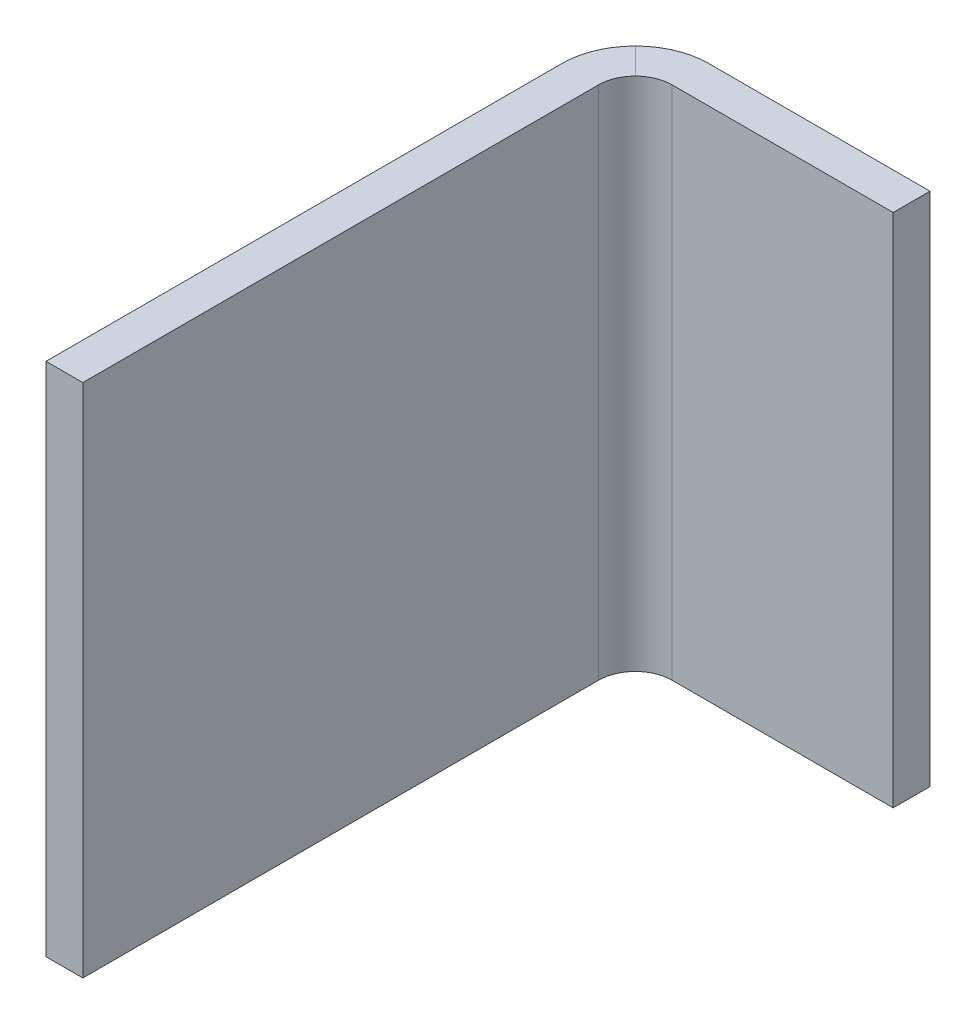
ISO-10303-21;
HEADER;
FILE_DESCRIPTION(('STEP AP214'),'2;1');
FILE_NAME('part.step','',(''),(''),'','','');
FILE_SCHEMA(('AUTOMOTIVE_DESIGN { 1 0 10303 214 1 1 1 1 }'));
ENDSEC;
DATA;
#1=APPLICATION_CONTEXT('core data for automotive mechanical design processes');
#2=APPLICATION_PROTOCOL_DEFINITION('international standard','automotive_design',2000,#1);
#3=PRODUCT_CONTEXT('',#1,'mechanical');
#4=PRODUCT('Part','Part','',(#3));
#5=PRODUCT_RELATED_PRODUCT_CATEGORY('part','',(#4));
#6=PRODUCT_DEFINITION_FORMATION('','',#4);
#7=PRODUCT_DEFINITION_CONTEXT('part definition',#1,'design');
#8=PRODUCT_DEFINITION('design','',#6,#7);
#9=PRODUCT_DEFINITION_SHAPE('','',#8);
#10=(LENGTH_UNIT() NAMED_UNIT(*) SI_UNIT(.MILLI.,.METRE.));
#11=(NAMED_UNIT(*) PLANE_ANGLE_UNIT() SI_UNIT($,.RADIAN.));
#12=(NAMED_UNIT(*) SI_UNIT($,.STERADIAN.) SOLID_ANGLE_UNIT());
#13=UNCERTAINTY_MEASURE_WITH_UNIT(LENGTH_MEASURE(1.E-05),#10,'distance_accuracy_value','');
#14=(GEOMETRIC_REPRESENTATION_CONTEXT(3) GLOBAL_UNCERTAINTY_ASSIGNED_CONTEXT((#13)) GLOBAL_UNIT_ASSIGNED_CONTEXT((#10,
#11,#12)) REPRESENTATION_CONTEXT('',''));
#15=CARTESIAN_POINT('',(0.,0.,0.));
#16=DIRECTION('',(0.,0.,1.));
#17=DIRECTION('',(1.,0.,0.));
#18=AXIS2_PLACEMENT_3D('',#15,#16,#17);
#19=CARTESIAN_POINT('',(25.4,0.,-50.8));
#20=DIRECTION('',(-1.,0.,0.));
#21=DIRECTION('',(0.,0.,1.));
#22=AXIS2_PLACEMENT_3D('',#19,#20,#21);
#23=PLANE('',#22);
#24=DIRECTION('',(0.,1.,0.));
#25=VECTOR('',#24,1.);
#26=CARTESIAN_POINT('',(25.4,-22.225,-47.625));
#27=LINE('',#26,#25);
#28=CARTESIAN_POINT('',(25.4,-22.225,-47.625));
#29=VERTEX_POINT('',#28);
#30=CARTESIAN_POINT('',(25.4,22.225,-47.625));
#31=VERTEX_POINT('',#30);
#32=EDGE_CURVE('E165',#29,#31,#27,.T.);
#33=ORIENTED_EDGE('',*,*,#32,.F.);
#34=DIRECTION('',(0.,0.,1.));
#35=VECTOR('',#34,1.);
#36=CARTESIAN_POINT('',(25.4,-22.225,-47.625));
#37=LINE('',#36,#35);
#38=CARTESIAN_POINT('',(25.4,-22.225,-50.8));
#39=VERTEX_POINT('',#38);
#40=EDGE_CURVE('E151',#39,#29,#37,.T.);
#41=ORIENTED_EDGE('',*,*,#40,.F.);
#42=DIRECTION('',(0.,-1.,0.));
#43=VECTOR('',#42,1.);
#44=CARTESIAN_POINT('',(25.4,-22.225,-50.8));
#45=LINE('',#44,#43);
#46=CARTESIAN_POINT('',(25.4,22.225,-50.8));
#47=VERTEX_POINT('',#46);
#48=EDGE_CURVE('E156',#47,#39,#45,.T.);
#49=ORIENTED_EDGE('',*,*,#48,.F.);
#50=DIRECTION('',(0.,0.,-1.));
#51=VECTOR('',#50,1.);
#52=CARTESIAN_POINT('',(25.4,22.225,-47.625));
#53=LINE('',#52,#51);
#54=EDGE_CURVE('E161',#31,#47,#53,.T.);
#55=ORIENTED_EDGE('',*,*,#54,.F.);
#56=EDGE_LOOP('',(#33,#41,#49,#55));
#57=FACE_BOUND('',#56,.T.);
#58=ADVANCED_FACE('F34',(#57),#23,.F.);
#59=CARTESIAN_POINT('',(0.,0.,0.));
#60=DIRECTION('',(0.,0.,1.));
#61=DIRECTION('',(1.,0.,0.));
#62=AXIS2_PLACEMENT_3D('',#59,#60,#61);
#63=PLANE('',#62);
#64=DIRECTION('',(0.,1.,0.));
#65=VECTOR('',#64,1.);
#66=CARTESIAN_POINT('',(3.175,-22.225,0.));
#67=LINE('',#66,#65);
#68=CARTESIAN_POINT('',(3.175,-22.225,0.));
#69=VERTEX_POINT('',#68);
#70=CARTESIAN_POINT('',(3.17499999999999,22.225,0.));
#71=VERTEX_POINT('',#70);
#72=EDGE_CURVE('E142',#69,#71,#67,.T.);
#73=ORIENTED_EDGE('',*,*,#72,.T.);
#74=DIRECTION('',(-1.,0.,0.));
#75=VECTOR('',#74,1.);
#76=CARTESIAN_POINT('',(3.17499999999999,22.225,0.));
#77=LINE('',#76,#75);
#78=CARTESIAN_POINT('',(0.,22.225,0.));
#79=VERTEX_POINT('',#78);
#80=EDGE_CURVE('E124',#71,#79,#77,.T.);
#81=ORIENTED_EDGE('',*,*,#80,.T.);
#82=DIRECTION('',(0.,-1.,0.));
#83=VECTOR('',#82,1.);
#84=CARTESIAN_POINT('',(0.,-22.225,0.));
#85=LINE('',#84,#83);
#86=CARTESIAN_POINT('',(0.,-22.225,0.));
#87=VERTEX_POINT('',#86);
#88=EDGE_CURVE('E120',#79,#87,#85,.T.);
#89=ORIENTED_EDGE('',*,*,#88,.T.);
#90=DIRECTION('',(1.,0.,0.));
#91=VECTOR('',#90,1.);
#92=CARTESIAN_POINT('',(3.175,-22.225,0.));
#93=LINE('',#92,#91);
#94=EDGE_CURVE('E111',#87,#69,#93,.T.);
#95=ORIENTED_EDGE('',*,*,#94,.T.);
#96=EDGE_LOOP('',(#73,#81,#89,#95));
#97=FACE_BOUND('',#96,.T.);
#98=ADVANCED_FACE('F123',(#97),#63,.T.);
#99=CARTESIAN_POINT('',(0.,-22.225,-47.625));
#100=DIRECTION('',(0.,0.,-1.));
#101=DIRECTION('',(0.,1.,0.));
#102=AXIS2_PLACEMENT_3D('',#99,#100,#101);
#103=PLANE('',#102);
#104=DIRECTION('',(1.,0.,0.));
#105=VECTOR('',#104,1.);
#106=CARTESIAN_POINT('',(0.,22.225,-47.625));
#107=LINE('',#106,#105);
#108=CARTESIAN_POINT('',(6.34999999999999,22.225,-47.625));
#109=VERTEX_POINT('',#108);
#110=EDGE_CURVE('E164',#109,#31,#107,.T.);
#111=ORIENTED_EDGE('',*,*,#110,.F.);
#112=DIRECTION('',(0.,-1.,0.));
#113=VECTOR('',#112,1.);
#114=CARTESIAN_POINT('',(6.35,-22.225,-47.625));
#115=LINE('',#114,#113);
#116=CARTESIAN_POINT('',(6.35,-22.225,-47.625));
#117=VERTEX_POINT('',#116);
#118=EDGE_CURVE('E143',#109,#117,#115,.T.);
#119=ORIENTED_EDGE('',*,*,#118,.T.);
#120=DIRECTION('',(1.,0.,0.));
#121=VECTOR('',#120,1.);
#122=CARTESIAN_POINT('',(0.,-22.225,-47.625));
#123=LINE('',#122,#121);
#124=EDGE_CURVE('E147',#117,#29,#123,.T.);
#125=ORIENTED_EDGE('',*,*,#124,.T.);
#126=ORIENTED_EDGE('',*,*,#32,.T.);
#127=EDGE_LOOP('',(#111,#119,#125,#126));
#128=FACE_BOUND('',#127,.T.);
#129=ADVANCED_FACE('F206',(#128),#103,.F.);
#130=CARTESIAN_POINT('',(0.,22.225,-47.625));
#131=DIRECTION('',(0.,-1.,0.));
#132=DIRECTION('',(0.,0.,-1.));
#133=AXIS2_PLACEMENT_3D('',#130,#131,#132);
#134=PLANE('',#133);
#135=DIRECTION('',(1.,0.,0.));
#136=VECTOR('',#135,1.);
#137=CARTESIAN_POINT('',(0.,22.225,-50.8));
#138=LINE('',#137,#136);
#139=CARTESIAN_POINT('',(6.34999999999999,22.225,-50.8));
#140=VERTEX_POINT('',#139);
#141=EDGE_CURVE('E159',#140,#47,#138,.T.);
#142=ORIENTED_EDGE('',*,*,#141,.F.);
#143=CARTESIAN_POINT('',(6.34999999999999,22.225,-44.45));
#144=DIRECTION('',(0.,-1.,0.));
#145=DIRECTION('',(0.,0.,-1.));
#146=AXIS2_PLACEMENT_3D('',#143,#144,#145);
#147=CIRCLE('',#146,6.35);
#148=CARTESIAN_POINT('',(1.85987193946541,22.225,-48.9401280605346));
#149=VERTEX_POINT('',#148);
#150=EDGE_CURVE('E42',#140,#149,#147,.F.);
#151=ORIENTED_EDGE('',*,*,#150,.T.);
#152=DIRECTION('',(0.707106781186548,0.,0.707106781186548));
#153=VECTOR('',#152,1.);
#154=CARTESIAN_POINT('',(26.9875,22.225,-23.8125));
#155=LINE('',#154,#153);
#156=CARTESIAN_POINT('',(4.1049359697327,22.225,-46.6950640302673));
#157=VERTEX_POINT('',#156);
#158=EDGE_CURVE('E134',#149,#157,#155,.T.);
#159=ORIENTED_EDGE('',*,*,#158,.T.);
#160=CARTESIAN_POINT('',(6.34999999999999,22.225,-44.45));
#161=DIRECTION('',(0.,-1.,0.));
#162=DIRECTION('',(0.,0.,-1.));
#163=AXIS2_PLACEMENT_3D('',#160,#161,#162);
#164=CIRCLE('',#163,3.175);
#165=EDGE_CURVE('E182',#157,#109,#164,.T.);
#166=ORIENTED_EDGE('',*,*,#165,.T.);
#167=ORIENTED_EDGE('',*,*,#110,.T.);
#168=ORIENTED_EDGE('',*,*,#54,.T.);
#169=EDGE_LOOP('',(#142,#151,#159,#166,#167,#168));
#170=FACE_BOUND('',#169,.T.);
#171=ADVANCED_FACE('F201',(#170),#134,.F.);
#172=CARTESIAN_POINT('',(0.,-22.225,-50.8));
#173=DIRECTION('',(0.,0.,1.));
#174=DIRECTION('',(0.,-1.,0.));
#175=AXIS2_PLACEMENT_3D('',#172,#173,#174);
#176=PLANE('',#175);
#177=DIRECTION('',(1.,0.,0.));
#178=VECTOR('',#177,1.);
#179=CARTESIAN_POINT('',(0.,-22.225,-50.8));
#180=LINE('',#179,#178);
#181=CARTESIAN_POINT('',(6.35,-22.225,-50.8));
#182=VERTEX_POINT('',#181);
#183=EDGE_CURVE('E154',#182,#39,#180,.T.);
#184=ORIENTED_EDGE('',*,*,#183,.F.);
#185=DIRECTION('',(0.,-1.,0.));
#186=VECTOR('',#185,1.);
#187=CARTESIAN_POINT('',(6.35,-22.225,-50.8));
#188=LINE('',#187,#186);
#189=EDGE_CURVE('E56',#182,#140,#188,.F.);
#190=ORIENTED_EDGE('',*,*,#189,.T.);
#191=ORIENTED_EDGE('',*,*,#141,.T.);
#192=ORIENTED_EDGE('',*,*,#48,.T.);
#193=EDGE_LOOP('',(#184,#190,#191,#192));
#194=FACE_BOUND('',#193,.T.);
#195=ADVANCED_FACE('F193',(#194),#176,.F.);
#196=CARTESIAN_POINT('',(0.,-22.225,-47.625));
#197=DIRECTION('',(0.,1.,0.));
#198=DIRECTION('',(0.,0.,1.));
#199=AXIS2_PLACEMENT_3D('',#196,#197,#198);
#200=PLANE('',#199);
#201=DIRECTION('',(-0.707106781186548,0.,-0.707106781186548));
#202=VECTOR('',#201,1.);
#203=CARTESIAN_POINT('',(26.9875,-22.225,-23.8125));
#204=LINE('',#203,#202);
#205=CARTESIAN_POINT('',(4.10493596973271,-22.225,-46.6950640302673));
#206=VERTEX_POINT('',#205);
#207=CARTESIAN_POINT('',(1.85987193946542,-22.225,-48.9401280605346));
#208=VERTEX_POINT('',#207);
#209=EDGE_CURVE('E138',#206,#208,#204,.T.);
#210=ORIENTED_EDGE('',*,*,#209,.T.);
#211=CARTESIAN_POINT('',(6.35,-22.225,-44.45));
#212=DIRECTION('',(0.,1.,0.));
#213=DIRECTION('',(0.,0.,1.));
#214=AXIS2_PLACEMENT_3D('',#211,#212,#213);
#215=CIRCLE('',#214,6.35);
#216=EDGE_CURVE('E187',#208,#182,#215,.F.);
#217=ORIENTED_EDGE('',*,*,#216,.T.);
#218=ORIENTED_EDGE('',*,*,#183,.T.);
#219=ORIENTED_EDGE('',*,*,#40,.T.);
#220=ORIENTED_EDGE('',*,*,#124,.F.);
#221=CARTESIAN_POINT('',(6.35,-22.225,-44.45));
#222=DIRECTION('',(0.,1.,0.));
#223=DIRECTION('',(0.,0.,1.));
#224=AXIS2_PLACEMENT_3D('',#221,#222,#223);
#225=CIRCLE('',#224,3.175);
#226=EDGE_CURVE('E174',#117,#206,#225,.T.);
#227=ORIENTED_EDGE('',*,*,#226,.T.);
#228=EDGE_LOOP('',(#210,#217,#218,#219,#220,#227));
#229=FACE_BOUND('',#228,.T.);
#230=ADVANCED_FACE('F191',(#229),#200,.F.);
#231=CARTESIAN_POINT('',(0.,-22.225,0.));
#232=DIRECTION('',(1.,0.,0.));
#233=DIRECTION('',(0.,1.,0.));
#234=AXIS2_PLACEMENT_3D('',#231,#232,#233);
#235=PLANE('',#234);
#236=DIRECTION('',(0.,0.,-1.));
#237=VECTOR('',#236,1.);
#238=CARTESIAN_POINT('',(0.,22.225,0.));
#239=LINE('',#238,#237);
#240=CARTESIAN_POINT('',(0.,22.225,-44.45));
#241=VERTEX_POINT('',#240);
#242=EDGE_CURVE('E133',#79,#241,#239,.T.);
#243=ORIENTED_EDGE('',*,*,#242,.T.);
#244=DIRECTION('',(0.,-1.,0.));
#245=VECTOR('',#244,1.);
#246=CARTESIAN_POINT('',(0.,-22.225,-44.45));
#247=LINE('',#246,#245);
#248=CARTESIAN_POINT('',(0.,-22.225,-44.45));
#249=VERTEX_POINT('',#248);
#250=EDGE_CURVE('E132',#241,#249,#247,.T.);
#251=ORIENTED_EDGE('',*,*,#250,.T.);
#252=DIRECTION('',(0.,0.,-1.));
#253=VECTOR('',#252,1.);
#254=CARTESIAN_POINT('',(0.,-22.225,0.));
#255=LINE('',#254,#253);
#256=EDGE_CURVE('E115',#87,#249,#255,.T.);
#257=ORIENTED_EDGE('',*,*,#256,.F.);
#258=ORIENTED_EDGE('',*,*,#88,.F.);
#259=EDGE_LOOP('',(#243,#251,#257,#258));
#260=FACE_BOUND('',#259,.T.);
#261=ADVANCED_FACE('F130',(#260),#235,.F.);
#262=CARTESIAN_POINT('',(3.175,-22.225,0.));
#263=DIRECTION('',(-1.,0.,0.));
#264=DIRECTION('',(0.,-1.,0.));
#265=AXIS2_PLACEMENT_3D('',#262,#263,#264);
#266=PLANE('',#265);
#267=DIRECTION('',(0.,0.,-1.));
#268=VECTOR('',#267,1.);
#269=CARTESIAN_POINT('',(3.175,-22.225,0.));
#270=LINE('',#269,#268);
#271=CARTESIAN_POINT('',(3.175,-22.225,-44.45));
#272=VERTEX_POINT('',#271);
#273=EDGE_CURVE('E117',#69,#272,#270,.T.);
#274=ORIENTED_EDGE('',*,*,#273,.T.);
#275=DIRECTION('',(0.,-1.,0.));
#276=VECTOR('',#275,1.);
#277=CARTESIAN_POINT('',(3.17499999999999,22.225,-44.45));
#278=LINE('',#277,#276);
#279=CARTESIAN_POINT('',(3.17499999999999,22.225,-44.45));
#280=VERTEX_POINT('',#279);
#281=EDGE_CURVE('E172',#272,#280,#278,.F.);
#282=ORIENTED_EDGE('',*,*,#281,.T.);
#283=DIRECTION('',(0.,0.,-1.));
#284=VECTOR('',#283,1.);
#285=CARTESIAN_POINT('',(3.17499999999999,22.225,0.));
#286=LINE('',#285,#284);
#287=EDGE_CURVE('E136',#71,#280,#286,.T.);
#288=ORIENTED_EDGE('',*,*,#287,.F.);
#289=ORIENTED_EDGE('',*,*,#72,.F.);
#290=EDGE_LOOP('',(#274,#282,#288,#289));
#291=FACE_BOUND('',#290,.T.);
#292=ADVANCED_FACE('F226',(#291),#266,.F.);
#293=CARTESIAN_POINT('',(3.17499999999999,22.225,0.));
#294=DIRECTION('',(0.,-1.,0.));
#295=DIRECTION('',(0.,0.,-1.));
#296=AXIS2_PLACEMENT_3D('',#293,#294,#295);
#297=PLANE('',#296);
#298=ORIENTED_EDGE('',*,*,#158,.F.);
#299=CARTESIAN_POINT('',(6.34999999999999,22.225,-44.45));
#300=DIRECTION('',(0.,-1.,0.));
#301=DIRECTION('',(0.,0.,-1.));
#302=AXIS2_PLACEMENT_3D('',#299,#300,#301);
#303=CIRCLE('',#302,6.35);
#304=EDGE_CURVE('E11',#149,#241,#303,.F.);
#305=ORIENTED_EDGE('',*,*,#304,.T.);
#306=ORIENTED_EDGE('',*,*,#242,.F.);
#307=ORIENTED_EDGE('',*,*,#80,.F.);
#308=ORIENTED_EDGE('',*,*,#287,.T.);
#309=CARTESIAN_POINT('',(6.34999999999999,22.225,-44.45));
#310=DIRECTION('',(0.,-1.,0.));
#311=DIRECTION('',(0.,0.,-1.));
#312=AXIS2_PLACEMENT_3D('',#309,#310,#311);
#313=CIRCLE('',#312,3.175);
#314=EDGE_CURVE('E179',#280,#157,#313,.T.);
#315=ORIENTED_EDGE('',*,*,#314,.T.);
#316=EDGE_LOOP('',(#298,#305,#306,#307,#308,#315));
#317=FACE_BOUND('',#316,.T.);
#318=ADVANCED_FACE('F198',(#317),#297,.F.);
#319=CARTESIAN_POINT('',(3.175,-22.225,0.));
#320=DIRECTION('',(0.,1.,0.));
#321=DIRECTION('',(0.,0.,1.));
#322=AXIS2_PLACEMENT_3D('',#319,#320,#321);
#323=PLANE('',#322);
#324=ORIENTED_EDGE('',*,*,#256,.T.);
#325=CARTESIAN_POINT('',(6.35,-22.225,-44.45));
#326=DIRECTION('',(0.,1.,0.));
#327=DIRECTION('',(0.,0.,1.));
#328=AXIS2_PLACEMENT_3D('',#325,#326,#327);
#329=CIRCLE('',#328,6.35);
#330=EDGE_CURVE('E185',#249,#208,#329,.F.);
#331=ORIENTED_EDGE('',*,*,#330,.T.);
#332=ORIENTED_EDGE('',*,*,#209,.F.);
#333=CARTESIAN_POINT('',(6.35,-22.225,-44.45));
#334=DIRECTION('',(0.,1.,0.));
#335=DIRECTION('',(0.,0.,1.));
#336=AXIS2_PLACEMENT_3D('',#333,#334,#335);
#337=CIRCLE('',#336,3.175);
#338=EDGE_CURVE('E177',#206,#272,#337,.T.);
#339=ORIENTED_EDGE('',*,*,#338,.T.);
#340=ORIENTED_EDGE('',*,*,#273,.F.);
#341=ORIENTED_EDGE('',*,*,#94,.F.);
#342=EDGE_LOOP('',(#324,#331,#332,#339,#340,#341));
#343=FACE_BOUND('',#342,.T.);
#344=ADVANCED_FACE('F113',(#343),#323,.F.);
#345=CARTESIAN_POINT('',(6.35,-22.225,-44.45));
#346=DIRECTION('',(0.,1.,0.));
#347=DIRECTION('',(0.,0.,1.));
#348=AXIS2_PLACEMENT_3D('',#345,#346,#347);
#349=CYLINDRICAL_SURFACE('',#348,3.175);
#350=ORIENTED_EDGE('',*,*,#314,.F.);
#351=ORIENTED_EDGE('',*,*,#281,.F.);
#352=ORIENTED_EDGE('',*,*,#338,.F.);
#353=ORIENTED_EDGE('',*,*,#226,.F.);
#354=ORIENTED_EDGE('',*,*,#118,.F.);
#355=ORIENTED_EDGE('',*,*,#165,.F.);
#356=EDGE_LOOP('',(#350,#351,#352,#353,#354,#355));
#357=FACE_BOUND('',#356,.T.);
#358=ADVANCED_FACE('F210',(#357),#349,.F.);
#359=CARTESIAN_POINT('',(6.35,-22.225,-44.45));
#360=DIRECTION('',(0.,-1.,0.));
#361=DIRECTION('',(0.,0.,-1.));
#362=AXIS2_PLACEMENT_3D('',#359,#360,#361);
#363=CYLINDRICAL_SURFACE('',#362,6.35);
#364=ORIENTED_EDGE('',*,*,#150,.F.);
#365=ORIENTED_EDGE('',*,*,#189,.F.);
#366=ORIENTED_EDGE('',*,*,#216,.F.);
#367=ORIENTED_EDGE('',*,*,#330,.F.);
#368=ORIENTED_EDGE('',*,*,#250,.F.);
#369=ORIENTED_EDGE('',*,*,#304,.F.);
#370=EDGE_LOOP('',(#364,#365,#366,#367,#368,#369));
#371=FACE_BOUND('',#370,.T.);
#372=ADVANCED_FACE('F36',(#371),#363,.T.);
#373=CLOSED_SHELL('',(#58,#98,#129,#171,#195,#230,#261,#292,#318,#344,#358,#372));
#374=MANIFOLD_SOLID_BREP('B2',#373);
#375=ADVANCED_BREP_SHAPE_REPRESENTATION('',(#18,#374),#14);
#376=SHAPE_DEFINITION_REPRESENTATION(#9,#375);
ENDSEC;
END-ISO-10303-21;
